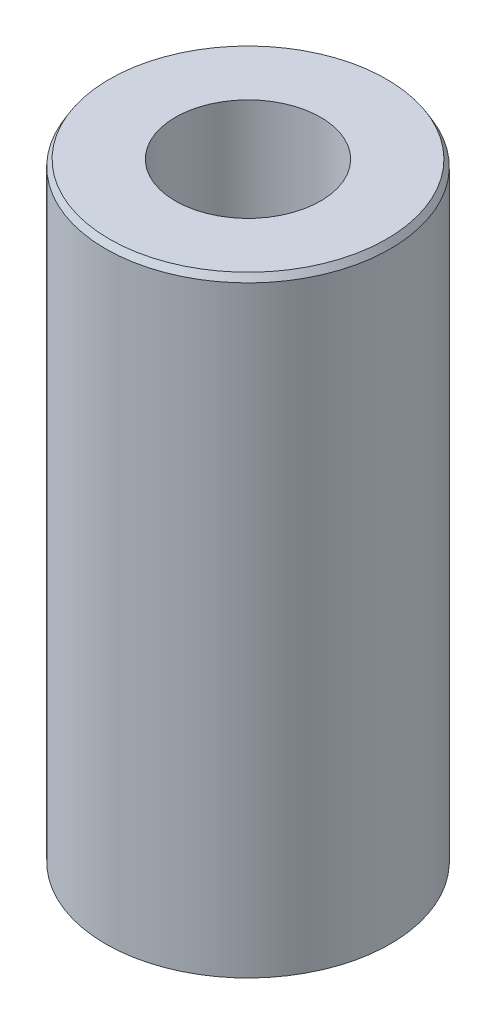
ISO-10303-21;
HEADER;
FILE_DESCRIPTION(('STEP AP214'),'2;1');
FILE_NAME('part.step','',(''),(''),'','','');
FILE_SCHEMA(('AUTOMOTIVE_DESIGN { 1 0 10303 214 1 1 1 1 }'));
ENDSEC;
DATA;
#1=APPLICATION_CONTEXT('core data for automotive mechanical design processes');
#2=APPLICATION_PROTOCOL_DEFINITION('international standard','automotive_design',2000,#1);
#3=PRODUCT_CONTEXT('',#1,'mechanical');
#4=PRODUCT('Part','Part','',(#3));
#5=PRODUCT_RELATED_PRODUCT_CATEGORY('part','',(#4));
#6=PRODUCT_DEFINITION_FORMATION('','',#4);
#7=PRODUCT_DEFINITION_CONTEXT('part definition',#1,'design');
#8=PRODUCT_DEFINITION('design','',#6,#7);
#9=PRODUCT_DEFINITION_SHAPE('','',#8);
#10=(LENGTH_UNIT() NAMED_UNIT(*) SI_UNIT(.MILLI.,.METRE.));
#11=(NAMED_UNIT(*) PLANE_ANGLE_UNIT() SI_UNIT($,.RADIAN.));
#12=(NAMED_UNIT(*) SI_UNIT($,.STERADIAN.) SOLID_ANGLE_UNIT());
#13=UNCERTAINTY_MEASURE_WITH_UNIT(LENGTH_MEASURE(1.E-05),#10,'distance_accuracy_value','');
#14=(GEOMETRIC_REPRESENTATION_CONTEXT(3) GLOBAL_UNCERTAINTY_ASSIGNED_CONTEXT((#13)) GLOBAL_UNIT_ASSIGNED_CONTEXT((#10,
#11,#12)) REPRESENTATION_CONTEXT('',''));
#15=CARTESIAN_POINT('',(0.,0.,0.));
#16=DIRECTION('',(0.,0.,1.));
#17=DIRECTION('',(1.,0.,0.));
#18=AXIS2_PLACEMENT_3D('',#15,#16,#17);
#19=CARTESIAN_POINT('',(0.,225.832721328208,0.));
#20=DIRECTION('',(0.,-1.,0.));
#21=DIRECTION('',(0.,0.,-1.));
#22=AXIS2_PLACEMENT_3D('',#19,#20,#21);
#23=CYLINDRICAL_SURFACE('',#22,52.5);
#24=CARTESIAN_POINT('',(0.,223.413709879652,0.));
#25=DIRECTION('',(0.,1.,0.));
#26=DIRECTION('',(0.,0.,1.));
#27=AXIS2_PLACEMENT_3D('',#24,#25,#26);
#28=CIRCLE('',#27,52.5);
#29=CARTESIAN_POINT('',(0.,223.413709879652,52.5));
#30=VERTEX_POINT('',#29);
#31=EDGE_CURVE('E50',#30,#30,#28,.F.);
#32=ORIENTED_EDGE('',*,*,#31,.T.);
#33=EDGE_LOOP('',(#32));
#34=FACE_BOUND('',#33,.T.);
#35=CARTESIAN_POINT('',(0.,1.39661691099602,0.));
#36=DIRECTION('',(0.,1.,0.));
#37=DIRECTION('',(0.,0.,1.));
#38=AXIS2_PLACEMENT_3D('',#35,#36,#37);
#39=CIRCLE('',#38,52.5);
#40=CARTESIAN_POINT('',(0.,1.39661691099602,52.5));
#41=VERTEX_POINT('',#40);
#42=EDGE_CURVE('E51',#41,#41,#39,.T.);
#43=ORIENTED_EDGE('',*,*,#42,.T.);
#44=EDGE_LOOP('',(#43));
#45=FACE_BOUND('',#44,.T.);
#46=ADVANCED_FACE('F39',(#34,#45),#23,.T.);
#47=CARTESIAN_POINT('',(0.,225.832721328208,0.));
#48=DIRECTION('',(0.,1.,0.));
#49=DIRECTION('',(0.,0.,1.));
#50=AXIS2_PLACEMENT_3D('',#47,#48,#49);
#51=PLANE('',#50);
#52=CARTESIAN_POINT('',(0.,225.832721328208,0.));
#53=DIRECTION('',(0.,1.,0.));
#54=DIRECTION('',(0.,0.,1.));
#55=AXIS2_PLACEMENT_3D('',#52,#53,#54);
#56=CIRCLE('',#55,51.1033830890039);
#57=CARTESIAN_POINT('',(0.,225.832721328208,51.1033830890039));
#58=VERTEX_POINT('',#57);
#59=EDGE_CURVE('E54',#58,#58,#56,.T.);
#60=ORIENTED_EDGE('',*,*,#59,.T.);
#61=EDGE_LOOP('',(#60));
#62=FACE_BOUND('',#61,.T.);
#63=CARTESIAN_POINT('',(0.,225.832721328208,0.));
#64=DIRECTION('',(0.,1.,0.));
#65=DIRECTION('',(0.,0.,1.));
#66=AXIS2_PLACEMENT_3D('',#63,#64,#65);
#67=CIRCLE('',#66,26.7832686737875);
#68=CARTESIAN_POINT('',(0.,225.832721328208,26.7832686737875));
#69=VERTEX_POINT('',#68);
#70=EDGE_CURVE('E58',#69,#69,#67,.T.);
#71=ORIENTED_EDGE('',*,*,#70,.F.);
#72=EDGE_LOOP('',(#71));
#73=FACE_BOUND('',#72,.T.);
#74=ADVANCED_FACE('F69',(#62,#73),#51,.T.);
#75=CARTESIAN_POINT('',(0.,0.,0.));
#76=DIRECTION('',(0.,1.,0.));
#77=DIRECTION('',(0.,0.,1.));
#78=AXIS2_PLACEMENT_3D('',#75,#76,#77);
#79=PLANE('',#78);
#80=CARTESIAN_POINT('',(0.,0.,0.));
#81=DIRECTION('',(0.,1.,0.));
#82=DIRECTION('',(0.,0.,1.));
#83=AXIS2_PLACEMENT_3D('',#80,#81,#82);
#84=CIRCLE('',#83,50.080988551445);
#85=CARTESIAN_POINT('',(0.,0.,50.080988551445));
#86=VERTEX_POINT('',#85);
#87=EDGE_CURVE('E10',#86,#86,#84,.F.);
#88=ORIENTED_EDGE('',*,*,#87,.T.);
#89=EDGE_LOOP('',(#88));
#90=FACE_BOUND('',#89,.T.);
#91=CARTESIAN_POINT('',(0.,0.,0.));
#92=DIRECTION('',(0.,1.,0.));
#93=DIRECTION('',(0.,0.,1.));
#94=AXIS2_PLACEMENT_3D('',#91,#92,#93);
#95=CIRCLE('',#94,26.7832686737875);
#96=CARTESIAN_POINT('',(0.,0.,26.7832686737875));
#97=VERTEX_POINT('',#96);
#98=EDGE_CURVE('E63',#97,#97,#95,.T.);
#99=ORIENTED_EDGE('',*,*,#98,.T.);
#100=EDGE_LOOP('',(#99));
#101=FACE_BOUND('',#100,.T.);
#102=ADVANCED_FACE('F75',(#90,#101),#79,.F.);
#103=CARTESIAN_POINT('',(0.,225.832721328208,0.));
#104=DIRECTION('',(0.,-1.,0.));
#105=DIRECTION('',(0.,0.,-1.));
#106=AXIS2_PLACEMENT_3D('',#103,#104,#105);
#107=CYLINDRICAL_SURFACE('',#106,26.7832686737875);
#108=ORIENTED_EDGE('',*,*,#70,.T.);
#109=EDGE_LOOP('',(#108));
#110=FACE_BOUND('',#109,.T.);
#111=ORIENTED_EDGE('',*,*,#98,.F.);
#112=EDGE_LOOP('',(#111));
#113=FACE_BOUND('',#112,.T.);
#114=ADVANCED_FACE('F70',(#110,#113),#107,.F.);
#115=CARTESIAN_POINT('',(0.,225.832721328208,0.));
#116=DIRECTION('',(0.,-1.,0.));
#117=DIRECTION('',(0.,0.,-1.));
#118=AXIS2_PLACEMENT_3D('',#115,#116,#117);
#119=CONICAL_SURFACE('',#118,51.1033830890039,0.523598775598302);
#120=ORIENTED_EDGE('',*,*,#31,.F.);
#121=EDGE_LOOP('',(#120));
#122=FACE_BOUND('',#121,.T.);
#123=ORIENTED_EDGE('',*,*,#59,.F.);
#124=EDGE_LOOP('',(#123));
#125=FACE_BOUND('',#124,.T.);
#126=ADVANCED_FACE('F81',(#122,#125),#119,.T.);
#127=CARTESIAN_POINT('',(0.,1.39661691099602,0.));
#128=DIRECTION('',(0.,1.,0.));
#129=DIRECTION('',(0.,0.,1.));
#130=AXIS2_PLACEMENT_3D('',#127,#128,#129);
#131=CONICAL_SURFACE('',#130,52.5,1.0471975511966);
#132=ORIENTED_EDGE('',*,*,#87,.F.);
#133=EDGE_LOOP('',(#132));
#134=FACE_BOUND('',#133,.T.);
#135=ORIENTED_EDGE('',*,*,#42,.F.);
#136=EDGE_LOOP('',(#135));
#137=FACE_BOUND('',#136,.T.);
#138=ADVANCED_FACE('F45',(#134,#137),#131,.T.);
#139=CLOSED_SHELL('',(#46,#74,#102,#114,#126,#138));
#140=MANIFOLD_SOLID_BREP('B2',#139);
#141=ADVANCED_BREP_SHAPE_REPRESENTATION('',(#18,#140),#14);
#142=SHAPE_DEFINITION_REPRESENTATION(#9,#141);
ENDSEC;
END-ISO-10303-21;
